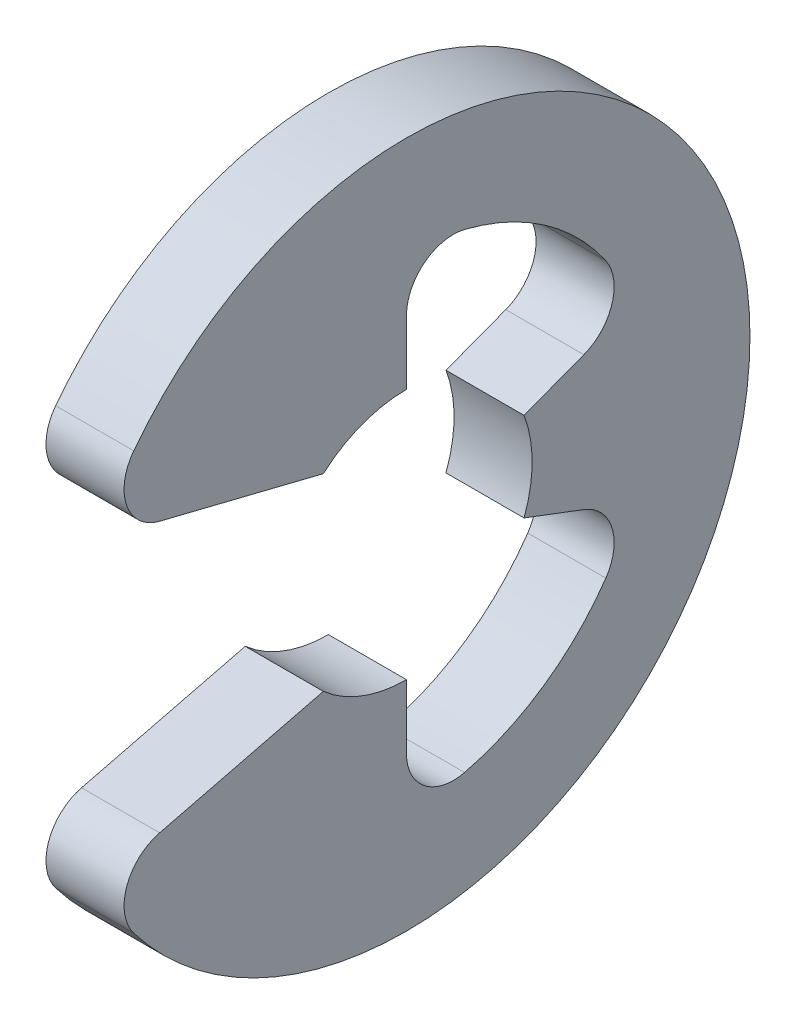
ISO-10303-21;
HEADER;
FILE_DESCRIPTION(('STEP AP214'),'2;1');
FILE_NAME('part.step','',(''),(''),'','','');
FILE_SCHEMA(('AUTOMOTIVE_DESIGN { 1 0 10303 214 1 1 1 1 }'));
ENDSEC;
DATA;
#1=APPLICATION_CONTEXT('core data for automotive mechanical design processes');
#2=APPLICATION_PROTOCOL_DEFINITION('international standard','automotive_design',2000,#1);
#3=PRODUCT_CONTEXT('',#1,'mechanical');
#4=PRODUCT('Part','Part','',(#3));
#5=PRODUCT_RELATED_PRODUCT_CATEGORY('part','',(#4));
#6=PRODUCT_DEFINITION_FORMATION('','',#4);
#7=PRODUCT_DEFINITION_CONTEXT('part definition',#1,'design');
#8=PRODUCT_DEFINITION('design','',#6,#7);
#9=PRODUCT_DEFINITION_SHAPE('','',#8);
#10=(LENGTH_UNIT() NAMED_UNIT(*) SI_UNIT(.MILLI.,.METRE.));
#11=(NAMED_UNIT(*) PLANE_ANGLE_UNIT() SI_UNIT($,.RADIAN.));
#12=(NAMED_UNIT(*) SI_UNIT($,.STERADIAN.) SOLID_ANGLE_UNIT());
#13=UNCERTAINTY_MEASURE_WITH_UNIT(LENGTH_MEASURE(1.E-05),#10,'distance_accuracy_value','');
#14=(GEOMETRIC_REPRESENTATION_CONTEXT(3) GLOBAL_UNCERTAINTY_ASSIGNED_CONTEXT((#13)) GLOBAL_UNIT_ASSIGNED_CONTEXT((#10,
#11,#12)) REPRESENTATION_CONTEXT('',''));
#15=CARTESIAN_POINT('',(0.,0.,0.));
#16=DIRECTION('',(0.,0.,1.));
#17=DIRECTION('',(1.,0.,0.));
#18=AXIS2_PLACEMENT_3D('',#15,#16,#17);
#19=CARTESIAN_POINT('',(0.25,0.,0.));
#20=DIRECTION('',(-1.,0.,0.));
#21=DIRECTION('',(0.,0.,1.));
#22=AXIS2_PLACEMENT_3D('',#19,#20,#21);
#23=CYLINDRICAL_SURFACE('',#22,2.2);
#24=CARTESIAN_POINT('',(0.25,0.,0.));
#25=DIRECTION('',(1.,0.,0.));
#26=DIRECTION('',(0.,0.,-1.));
#27=AXIS2_PLACEMENT_3D('',#24,#25,#26);
#28=CIRCLE('',#27,2.2);
#29=CARTESIAN_POINT('',(0.249999999999945,-1.33757286853182,1.74668223251034));
#30=VERTEX_POINT('',#29);
#31=CARTESIAN_POINT('',(0.249999999999834,1.33757286853182,1.74668223251034));
#32=VERTEX_POINT('',#31);
#33=EDGE_CURVE('E178',#30,#32,#28,.T.);
#34=ORIENTED_EDGE('',*,*,#33,.F.);
#35=DIRECTION('',(-1.,0.,0.));
#36=VECTOR('',#35,1.);
#37=CARTESIAN_POINT('',(0.249999999999945,-1.33757286853182,1.74668223251034));
#38=LINE('',#37,#36);
#39=CARTESIAN_POINT('',(-0.250000000000056,-1.33757286853185,1.7466822325104));
#40=VERTEX_POINT('',#39);
#41=EDGE_CURVE('E308',#30,#40,#38,.T.);
#42=ORIENTED_EDGE('',*,*,#41,.T.);
#43=CARTESIAN_POINT('',(-0.25,0.,0.));
#44=DIRECTION('',(1.,0.,0.));
#45=DIRECTION('',(0.,0.,-1.));
#46=AXIS2_PLACEMENT_3D('',#43,#44,#45);
#47=CIRCLE('',#46,2.2);
#48=CARTESIAN_POINT('',(-0.250000000000167,1.33757286853185,1.7466822325104));
#49=VERTEX_POINT('',#48);
#50=EDGE_CURVE('E228',#40,#49,#47,.T.);
#51=ORIENTED_EDGE('',*,*,#50,.T.);
#52=DIRECTION('',(-1.,0.,0.));
#53=VECTOR('',#52,1.);
#54=CARTESIAN_POINT('',(0.249999999999834,1.33757286853182,1.74668223251034));
#55=LINE('',#54,#53);
#56=EDGE_CURVE('E305',#49,#32,#55,.F.);
#57=ORIENTED_EDGE('',*,*,#56,.T.);
#58=EDGE_LOOP('',(#34,#42,#51,#57));
#59=FACE_BOUND('',#58,.T.);
#60=ADVANCED_FACE('F38',(#59),#23,.T.);
#61=CARTESIAN_POINT('',(0.249999999999778,0.962679314189765,1.9781932509314));
#62=DIRECTION('',(0.,0.970536829925373,-0.240952820606873));
#63=DIRECTION('',(0.,0.240952820606873,0.970536829925373));
#64=AXIS2_PLACEMENT_3D('',#61,#62,#63);
#65=PLANE('',#64);
#66=DIRECTION('',(0.,-0.240952820606873,-0.970536829925373));
#67=VECTOR('',#66,1.);
#68=CARTESIAN_POINT('',(0.249999999999778,0.962679314189765,1.9781932509314));
#69=LINE('',#68,#67);
#70=CARTESIAN_POINT('',(0.250000000000056,0.864015519299904,1.58078413789547));
#71=VERTEX_POINT('',#70);
#72=CARTESIAN_POINT('',(0.249999999999924,0.603749999999986,0.532457451351692));
#73=VERTEX_POINT('',#72);
#74=EDGE_CURVE('E163',#71,#73,#69,.T.);
#75=ORIENTED_EDGE('',*,*,#74,.F.);
#76=DIRECTION('',(-1.,0.,0.));
#77=VECTOR('',#76,1.);
#78=CARTESIAN_POINT('',(0.250000000000056,0.864015519299904,1.58078413789547));
#79=LINE('',#78,#77);
#80=CARTESIAN_POINT('',(-0.249999999999945,0.864015519299877,1.58078413789559));
#81=VERTEX_POINT('',#80);
#82=EDGE_CURVE('E326',#71,#81,#79,.T.);
#83=ORIENTED_EDGE('',*,*,#82,.T.);
#84=DIRECTION('',(0.,-0.240952820606873,-0.970536829925373));
#85=VECTOR('',#84,1.);
#86=CARTESIAN_POINT('',(-0.250000000000222,0.962679314189821,1.97819325093151));
#87=LINE('',#86,#85);
#88=CARTESIAN_POINT('',(-0.250000000000077,0.603750000000014,0.532457451351748));
#89=VERTEX_POINT('',#88);
#90=EDGE_CURVE('E184',#81,#89,#87,.T.);
#91=ORIENTED_EDGE('',*,*,#90,.T.);
#92=DIRECTION('',(-1.,0.,0.));
#93=VECTOR('',#92,1.);
#94=CARTESIAN_POINT('',(0.249999999999924,0.603749999999986,0.532457451351692));
#95=LINE('',#94,#93);
#96=EDGE_CURVE('E181',#73,#89,#95,.T.);
#97=ORIENTED_EDGE('',*,*,#96,.F.);
#98=EDGE_LOOP('',(#75,#83,#91,#97));
#99=FACE_BOUND('',#98,.T.);
#100=ADVANCED_FACE('F182',(#99),#65,.F.);
#101=CARTESIAN_POINT('',(0.25,0.,0.));
#102=DIRECTION('',(-1.,0.,0.));
#103=DIRECTION('',(0.,0.,1.));
#104=AXIS2_PLACEMENT_3D('',#101,#102,#103);
#105=CYLINDRICAL_SURFACE('',#104,0.805);
#106=CARTESIAN_POINT('',(-0.25,0.,0.));
#107=DIRECTION('',(-1.,0.,0.));
#108=DIRECTION('',(0.,0.,1.));
#109=AXIS2_PLACEMENT_3D('',#106,#107,#108);
#110=CIRCLE('',#109,0.805);
#111=CARTESIAN_POINT('',(-0.25,0.805,0.));
#112=VERTEX_POINT('',#111);
#113=EDGE_CURVE('E234',#89,#112,#110,.T.);
#114=ORIENTED_EDGE('',*,*,#113,.T.);
#115=DIRECTION('',(-1.,0.,0.));
#116=VECTOR('',#115,1.);
#117=CARTESIAN_POINT('',(0.25,0.805000000000042,-1.11022302462516E-13));
#118=LINE('',#117,#116);
#119=CARTESIAN_POINT('',(0.25,0.805000000000042,-1.11022302462516E-13));
#120=VERTEX_POINT('',#119);
#121=EDGE_CURVE('E189',#120,#112,#118,.T.);
#122=ORIENTED_EDGE('',*,*,#121,.F.);
#123=CARTESIAN_POINT('',(0.25,0.,0.));
#124=DIRECTION('',(-1.,0.,0.));
#125=DIRECTION('',(0.,0.,1.));
#126=AXIS2_PLACEMENT_3D('',#123,#124,#125);
#127=CIRCLE('',#126,0.805);
#128=EDGE_CURVE('E169',#73,#120,#127,.T.);
#129=ORIENTED_EDGE('',*,*,#128,.F.);
#130=ORIENTED_EDGE('',*,*,#96,.T.);
#131=EDGE_LOOP('',(#114,#122,#129,#130));
#132=FACE_BOUND('',#131,.T.);
#133=ADVANCED_FACE('F191',(#132),#105,.F.);
#134=CARTESIAN_POINT('',(0.25,0.805000000000042,-1.11022302462516E-13));
#135=DIRECTION('',(0.,0.,1.));
#136=DIRECTION('',(0.,-1.,0.));
#137=AXIS2_PLACEMENT_3D('',#134,#135,#136);
#138=PLANE('',#137);
#139=DIRECTION('',(0.,1.,0.));
#140=VECTOR('',#139,1.);
#141=CARTESIAN_POINT('',(-0.25,0.805,0.));
#142=LINE('',#141,#140);
#143=CARTESIAN_POINT('',(-0.249999999999889,1.21446296417932,0.));
#144=VERTEX_POINT('',#143);
#145=EDGE_CURVE('E237',#112,#144,#142,.T.);
#146=ORIENTED_EDGE('',*,*,#145,.T.);
#147=DIRECTION('',(1.,0.,0.));
#148=VECTOR('',#147,1.);
#149=CARTESIAN_POINT('',(0.250000000000111,1.21446296417935,-1.11022302462516E-13));
#150=LINE('',#149,#148);
#151=CARTESIAN_POINT('',(0.250000000000111,1.21446296417935,-1.11022302462516E-13));
#152=VERTEX_POINT('',#151);
#153=EDGE_CURVE('E302',#144,#152,#150,.T.);
#154=ORIENTED_EDGE('',*,*,#153,.T.);
#155=DIRECTION('',(0.,1.,0.));
#156=VECTOR('',#155,1.);
#157=CARTESIAN_POINT('',(0.25,0.805000000000042,-1.11022302462516E-13));
#158=LINE('',#157,#156);
#159=EDGE_CURVE('E195',#120,#152,#158,.T.);
#160=ORIENTED_EDGE('',*,*,#159,.F.);
#161=ORIENTED_EDGE('',*,*,#121,.T.);
#162=EDGE_LOOP('',(#146,#154,#160,#161));
#163=FACE_BOUND('',#162,.T.);
#164=ADVANCED_FACE('F458',(#163),#138,.F.);
#165=CARTESIAN_POINT('',(0.25,0.,0.));
#166=DIRECTION('',(-1.,0.,0.));
#167=DIRECTION('',(0.,0.,1.));
#168=AXIS2_PLACEMENT_3D('',#165,#166,#167);
#169=CYLINDRICAL_SURFACE('',#168,1.55096774193548);
#170=CARTESIAN_POINT('',(0.25,0.,0.));
#171=DIRECTION('',(-1.,0.,0.));
#172=DIRECTION('',(0.,0.,-1.));
#173=AXIS2_PLACEMENT_3D('',#170,#171,#172);
#174=CIRCLE('',#173,1.55096774193548);
#175=CARTESIAN_POINT('',(0.250000000000167,1.50570859509386,-0.371944301186228));
#176=VERTEX_POINT('',#175);
#177=CARTESIAN_POINT('',(0.249999999999855,0.880270414541348,-1.27695925299445));
#178=VERTEX_POINT('',#177);
#179=EDGE_CURVE('E199',#176,#178,#174,.T.);
#180=ORIENTED_EDGE('',*,*,#179,.F.);
#181=DIRECTION('',(-1.,0.,0.));
#182=VECTOR('',#181,1.);
#183=CARTESIAN_POINT('',(0.250000000000167,1.50570859509386,-0.371944301186228));
#184=LINE('',#183,#182);
#185=CARTESIAN_POINT('',(-0.249999999999834,1.50570859509387,-0.371944301186145));
#186=VERTEX_POINT('',#185);
#187=EDGE_CURVE('E298',#176,#186,#184,.T.);
#188=ORIENTED_EDGE('',*,*,#187,.T.);
#189=CARTESIAN_POINT('',(-0.25,0.,0.));
#190=DIRECTION('',(-1.,0.,0.));
#191=DIRECTION('',(0.,0.,-1.));
#192=AXIS2_PLACEMENT_3D('',#189,#190,#191);
#193=CIRCLE('',#192,1.55096774193548);
#194=CARTESIAN_POINT('',(-0.250000000000146,0.880270414541362,-1.27695925299418));
#195=VERTEX_POINT('',#194);
#196=EDGE_CURVE('E241',#186,#195,#193,.T.);
#197=ORIENTED_EDGE('',*,*,#196,.T.);
#198=DIRECTION('',(-1.,0.,0.));
#199=VECTOR('',#198,1.);
#200=CARTESIAN_POINT('',(0.249999999999855,0.880270414541348,-1.27695925299445));
#201=LINE('',#200,#199);
#202=EDGE_CURVE('E295',#195,#178,#201,.F.);
#203=ORIENTED_EDGE('',*,*,#202,.T.);
#204=EDGE_LOOP('',(#180,#188,#197,#203));
#205=FACE_BOUND('',#204,.T.);
#206=ADVANCED_FACE('F365',(#205),#169,.F.);
#207=CARTESIAN_POINT('',(0.250000000000056,0.284610479427627,-0.753008549088385));
#208=DIRECTION('',(0.,-0.935414346693485,-0.353553390593274));
#209=DIRECTION('',(0.,0.353553390593274,-0.935414346693485));
#210=AXIS2_PLACEMENT_3D('',#207,#208,#209);
#211=PLANE('',#210);
#212=DIRECTION('',(0.,-0.353553390593274,0.935414346693485));
#213=VECTOR('',#212,1.);
#214=CARTESIAN_POINT('',(0.250000000000056,0.284610479427627,-0.753008549088385));
#215=LINE('',#214,#213);
#216=CARTESIAN_POINT('',(0.249999999999743,0.429377498735603,-1.13602608022154));
#217=VERTEX_POINT('',#216);
#218=CARTESIAN_POINT('',(0.250000000000056,0.284610479427627,-0.753008549088385));
#219=VERTEX_POINT('',#218);
#220=EDGE_CURVE('E205',#217,#219,#215,.T.);
#221=ORIENTED_EDGE('',*,*,#220,.F.);
#222=DIRECTION('',(1.,0.,0.));
#223=VECTOR('',#222,1.);
#224=CARTESIAN_POINT('',(-0.250000000000257,0.429377498735561,-1.13602608022109));
#225=LINE('',#224,#223);
#226=CARTESIAN_POINT('',(-0.250000000000257,0.429377498735561,-1.13602608022109));
#227=VERTEX_POINT('',#226);
#228=EDGE_CURVE('E331',#217,#227,#225,.F.);
#229=ORIENTED_EDGE('',*,*,#228,.T.);
#230=DIRECTION('',(0.,-0.353553390593274,0.935414346693485));
#231=VECTOR('',#230,1.);
#232=CARTESIAN_POINT('',(-0.249999999999945,0.284610479427599,-0.753008549088247));
#233=LINE('',#232,#231);
#234=CARTESIAN_POINT('',(-0.249999999999945,0.284610479427599,-0.753008549088247));
#235=VERTEX_POINT('',#234);
#236=EDGE_CURVE('E245',#227,#235,#233,.T.);
#237=ORIENTED_EDGE('',*,*,#236,.T.);
#238=DIRECTION('',(-1.,0.,0.));
#239=VECTOR('',#238,1.);
#240=CARTESIAN_POINT('',(0.250000000000056,0.284610479427627,-0.753008549088385));
#241=LINE('',#240,#239);
#242=EDGE_CURVE('E279',#219,#235,#241,.T.);
#243=ORIENTED_EDGE('',*,*,#242,.F.);
#244=EDGE_LOOP('',(#221,#229,#237,#243));
#245=FACE_BOUND('',#244,.T.);
#246=ADVANCED_FACE('F368',(#245),#211,.F.);
#247=CARTESIAN_POINT('',(0.25,0.,0.));
#248=DIRECTION('',(-1.,0.,0.));
#249=DIRECTION('',(0.,0.,1.));
#250=AXIS2_PLACEMENT_3D('',#247,#248,#249);
#251=CYLINDRICAL_SURFACE('',#250,0.805);
#252=CARTESIAN_POINT('',(-0.25,0.,0.));
#253=DIRECTION('',(-1.,0.,0.));
#254=DIRECTION('',(0.,0.,1.));
#255=AXIS2_PLACEMENT_3D('',#252,#253,#254);
#256=CIRCLE('',#255,0.805);
#257=CARTESIAN_POINT('',(-0.249999999999945,-0.284610479427599,-0.753008549088247));
#258=VERTEX_POINT('',#257);
#259=EDGE_CURVE('E248',#235,#258,#256,.T.);
#260=ORIENTED_EDGE('',*,*,#259,.T.);
#261=DIRECTION('',(-1.,0.,0.));
#262=VECTOR('',#261,1.);
#263=CARTESIAN_POINT('',(0.250000000000056,-0.284610479427599,-0.753008549088247));
#264=LINE('',#263,#262);
#265=CARTESIAN_POINT('',(0.250000000000056,-0.284610479427599,-0.753008549088247));
#266=VERTEX_POINT('',#265);
#267=EDGE_CURVE('E275',#266,#258,#264,.T.);
#268=ORIENTED_EDGE('',*,*,#267,.F.);
#269=CARTESIAN_POINT('',(0.25,0.,0.));
#270=DIRECTION('',(-1.,0.,0.));
#271=DIRECTION('',(0.,0.,1.));
#272=AXIS2_PLACEMENT_3D('',#269,#270,#271);
#273=CIRCLE('',#272,0.805);
#274=EDGE_CURVE('E208',#219,#266,#273,.T.);
#275=ORIENTED_EDGE('',*,*,#274,.F.);
#276=ORIENTED_EDGE('',*,*,#242,.T.);
#277=EDGE_LOOP('',(#260,#268,#275,#276));
#278=FACE_BOUND('',#277,.T.);
#279=ADVANCED_FACE('F374',(#278),#251,.F.);
#280=CARTESIAN_POINT('',(0.250000000000056,-0.284610479427599,-0.753008549088247));
#281=DIRECTION('',(0.,0.935414346693485,-0.353553390593274));
#282=DIRECTION('',(0.,0.353553390593274,0.935414346693485));
#283=AXIS2_PLACEMENT_3D('',#280,#281,#282);
#284=PLANE('',#283);
#285=DIRECTION('',(0.,-0.353553390593274,-0.935414346693485));
#286=VECTOR('',#285,1.);
#287=CARTESIAN_POINT('',(-0.249999999999945,-0.284610479427599,-0.753008549088247));
#288=LINE('',#287,#286);
#289=CARTESIAN_POINT('',(-0.250000000000257,-0.429377498735506,-1.13602608022104));
#290=VERTEX_POINT('',#289);
#291=EDGE_CURVE('E251',#258,#290,#288,.T.);
#292=ORIENTED_EDGE('',*,*,#291,.T.);
#293=DIRECTION('',(1.,0.,0.));
#294=VECTOR('',#293,1.);
#295=CARTESIAN_POINT('',(0.249999999999743,-0.429377498735506,-1.13602608022137));
#296=LINE('',#295,#294);
#297=CARTESIAN_POINT('',(0.249999999999743,-0.429377498735506,-1.13602608022137));
#298=VERTEX_POINT('',#297);
#299=EDGE_CURVE('E54',#290,#298,#296,.T.);
#300=ORIENTED_EDGE('',*,*,#299,.T.);
#301=DIRECTION('',(0.,-0.353553390593274,-0.935414346693485));
#302=VECTOR('',#301,1.);
#303=CARTESIAN_POINT('',(0.250000000000056,-0.284610479427599,-0.753008549088247));
#304=LINE('',#303,#302);
#305=EDGE_CURVE('E211',#266,#298,#304,.T.);
#306=ORIENTED_EDGE('',*,*,#305,.F.);
#307=ORIENTED_EDGE('',*,*,#267,.T.);
#308=EDGE_LOOP('',(#292,#300,#306,#307));
#309=FACE_BOUND('',#308,.T.);
#310=ADVANCED_FACE('F376',(#309),#284,.F.);
#311=CARTESIAN_POINT('',(0.25,0.,0.));
#312=DIRECTION('',(-1.,0.,0.));
#313=DIRECTION('',(0.,0.,1.));
#314=AXIS2_PLACEMENT_3D('',#311,#312,#313);
#315=CYLINDRICAL_SURFACE('',#314,1.55096774193548);
#316=CARTESIAN_POINT('',(-0.25,0.,0.));
#317=DIRECTION('',(-1.,0.,0.));
#318=DIRECTION('',(0.,0.,-1.));
#319=AXIS2_PLACEMENT_3D('',#316,#317,#318);
#320=CIRCLE('',#319,1.55096774193548);
#321=CARTESIAN_POINT('',(-0.250000000000215,-0.880270414541307,-1.27695925299415));
#322=VERTEX_POINT('',#321);
#323=CARTESIAN_POINT('',(-0.249999999999945,-1.50570859509387,-0.371944301186172));
#324=VERTEX_POINT('',#323);
#325=EDGE_CURVE('E254',#322,#324,#320,.T.);
#326=ORIENTED_EDGE('',*,*,#325,.T.);
#327=DIRECTION('',(-1.,0.,0.));
#328=VECTOR('',#327,1.);
#329=CARTESIAN_POINT('',(0.250000000000056,-1.50570859509391,-0.371944301186283));
#330=LINE('',#329,#328);
#331=CARTESIAN_POINT('',(0.250000000000056,-1.50570859509391,-0.371944301186283));
#332=VERTEX_POINT('',#331);
#333=EDGE_CURVE('E292',#324,#332,#330,.F.);
#334=ORIENTED_EDGE('',*,*,#333,.T.);
#335=CARTESIAN_POINT('',(0.25,0.,0.));
#336=DIRECTION('',(-1.,0.,0.));
#337=DIRECTION('',(0.,0.,-1.));
#338=AXIS2_PLACEMENT_3D('',#335,#336,#337);
#339=CIRCLE('',#338,1.55096774193548);
#340=CARTESIAN_POINT('',(0.249999999999785,-0.880270414541265,-1.27695925299451));
#341=VERTEX_POINT('',#340);
#342=EDGE_CURVE('E214',#341,#332,#339,.T.);
#343=ORIENTED_EDGE('',*,*,#342,.F.);
#344=DIRECTION('',(-1.,0.,0.));
#345=VECTOR('',#344,1.);
#346=CARTESIAN_POINT('',(0.249999999999785,-0.880270414541265,-1.27695925299451));
#347=LINE('',#346,#345);
#348=EDGE_CURVE('E288',#341,#322,#347,.T.);
#349=ORIENTED_EDGE('',*,*,#348,.T.);
#350=EDGE_LOOP('',(#326,#334,#343,#349));
#351=FACE_BOUND('',#350,.T.);
#352=ADVANCED_FACE('F378',(#351),#315,.F.);
#353=CARTESIAN_POINT('',(0.25,-0.805000000000014,-1.38777878078145E-13));
#354=DIRECTION('',(0.,0.,1.));
#355=DIRECTION('',(0.,-1.,0.));
#356=AXIS2_PLACEMENT_3D('',#353,#354,#355);
#357=PLANE('',#356);
#358=DIRECTION('',(0.,1.,0.));
#359=VECTOR('',#358,1.);
#360=CARTESIAN_POINT('',(0.25,-0.805000000000014,-1.38777878078145E-13));
#361=LINE('',#360,#359);
#362=CARTESIAN_POINT('',(0.25,-1.21446296417931,0.));
#363=VERTEX_POINT('',#362);
#364=CARTESIAN_POINT('',(0.25,-0.805000000000014,-1.38777878078145E-13));
#365=VERTEX_POINT('',#364);
#366=EDGE_CURVE('E218',#363,#365,#361,.T.);
#367=ORIENTED_EDGE('',*,*,#366,.F.);
#368=DIRECTION('',(1.,0.,0.));
#369=VECTOR('',#368,1.);
#370=CARTESIAN_POINT('',(-0.25,-1.21446296417931,0.));
#371=LINE('',#370,#369);
#372=CARTESIAN_POINT('',(-0.25,-1.21446296417931,0.));
#373=VERTEX_POINT('',#372);
#374=EDGE_CURVE('E188',#363,#373,#371,.F.);
#375=ORIENTED_EDGE('',*,*,#374,.T.);
#376=DIRECTION('',(0.,1.,0.));
#377=VECTOR('',#376,1.);
#378=CARTESIAN_POINT('',(-0.25,-0.804999999999986,0.));
#379=LINE('',#378,#377);
#380=CARTESIAN_POINT('',(-0.25,-0.804999999999986,0.));
#381=VERTEX_POINT('',#380);
#382=EDGE_CURVE('E258',#373,#381,#379,.T.);
#383=ORIENTED_EDGE('',*,*,#382,.T.);
#384=DIRECTION('',(-1.,0.,0.));
#385=VECTOR('',#384,1.);
#386=CARTESIAN_POINT('',(0.25,-0.805000000000014,-1.38777878078145E-13));
#387=LINE('',#386,#385);
#388=EDGE_CURVE('E271',#365,#381,#387,.T.);
#389=ORIENTED_EDGE('',*,*,#388,.F.);
#390=EDGE_LOOP('',(#367,#375,#383,#389));
#391=FACE_BOUND('',#390,.T.);
#392=ADVANCED_FACE('F384',(#391),#357,.F.);
#393=CARTESIAN_POINT('',(0.25,0.,0.));
#394=DIRECTION('',(-1.,0.,0.));
#395=DIRECTION('',(0.,0.,1.));
#396=AXIS2_PLACEMENT_3D('',#393,#394,#395);
#397=CYLINDRICAL_SURFACE('',#396,0.805);
#398=CARTESIAN_POINT('',(-0.25,0.,0.));
#399=DIRECTION('',(-1.,0.,0.));
#400=DIRECTION('',(0.,0.,-1.));
#401=AXIS2_PLACEMENT_3D('',#398,#399,#400);
#402=CIRCLE('',#401,0.805);
#403=CARTESIAN_POINT('',(-0.250000000000007,-0.603749999999986,0.532457451351748));
#404=VERTEX_POINT('',#403);
#405=EDGE_CURVE('E261',#381,#404,#402,.T.);
#406=ORIENTED_EDGE('',*,*,#405,.T.);
#407=DIRECTION('',(-1.,0.,0.));
#408=VECTOR('',#407,1.);
#409=CARTESIAN_POINT('',(0.249999999999993,-0.603749999999903,0.532457451351553));
#410=LINE('',#409,#408);
#411=CARTESIAN_POINT('',(0.249999999999993,-0.603749999999903,0.532457451351553));
#412=VERTEX_POINT('',#411);
#413=EDGE_CURVE('E227',#412,#404,#410,.T.);
#414=ORIENTED_EDGE('',*,*,#413,.F.);
#415=CARTESIAN_POINT('',(0.25,0.,0.));
#416=DIRECTION('',(-1.,0.,0.));
#417=DIRECTION('',(0.,0.,-1.));
#418=AXIS2_PLACEMENT_3D('',#415,#416,#417);
#419=CIRCLE('',#418,0.805);
#420=EDGE_CURVE('E221',#365,#412,#419,.T.);
#421=ORIENTED_EDGE('',*,*,#420,.F.);
#422=ORIENTED_EDGE('',*,*,#388,.T.);
#423=EDGE_LOOP('',(#406,#414,#421,#422));
#424=FACE_BOUND('',#423,.T.);
#425=ADVANCED_FACE('F433',(#424),#397,.F.);
#426=CARTESIAN_POINT('',(0.249999999999778,-0.962679314189821,1.97819325093146));
#427=DIRECTION('',(0.,-0.970536829925373,-0.240952820606873));
#428=DIRECTION('',(0.,0.240952820606873,-0.970536829925373));
#429=AXIS2_PLACEMENT_3D('',#426,#427,#428);
#430=PLANE('',#429);
#431=DIRECTION('',(0.,-0.240952820606873,0.970536829925373));
#432=VECTOR('',#431,1.);
#433=CARTESIAN_POINT('',(-0.250000000000222,-0.962679314189793,1.97819325093154));
#434=LINE('',#433,#432);
#435=CARTESIAN_POINT('',(-0.249999999999945,-0.864015519299863,1.58078413789559));
#436=VERTEX_POINT('',#435);
#437=EDGE_CURVE('E264',#404,#436,#434,.T.);
#438=ORIENTED_EDGE('',*,*,#437,.T.);
#439=DIRECTION('',(-1.,0.,0.));
#440=VECTOR('',#439,1.);
#441=CARTESIAN_POINT('',(0.250000000000056,-0.864015519299904,1.58078413789547));
#442=LINE('',#441,#440);
#443=CARTESIAN_POINT('',(0.250000000000056,-0.864015519299904,1.58078413789547));
#444=VERTEX_POINT('',#443);
#445=EDGE_CURVE('E318',#436,#444,#442,.F.);
#446=ORIENTED_EDGE('',*,*,#445,.T.);
#447=DIRECTION('',(0.,-0.240952820606873,0.970536829925373));
#448=VECTOR('',#447,1.);
#449=CARTESIAN_POINT('',(0.249999999999778,-0.962679314189821,1.97819325093146));
#450=LINE('',#449,#448);
#451=EDGE_CURVE('E224',#412,#444,#450,.T.);
#452=ORIENTED_EDGE('',*,*,#451,.F.);
#453=ORIENTED_EDGE('',*,*,#413,.T.);
#454=EDGE_LOOP('',(#438,#446,#452,#453));
#455=FACE_BOUND('',#454,.T.);
#456=ADVANCED_FACE('F505',(#455),#430,.F.);
#457=CARTESIAN_POINT('',(0.25,0.,0.));
#458=DIRECTION('',(1.,0.,0.));
#459=DIRECTION('',(0.,0.,-1.));
#460=AXIS2_PLACEMENT_3D('',#457,#458,#459);
#461=PLANE('',#460);
#462=ORIENTED_EDGE('',*,*,#451,.T.);
#463=CARTESIAN_POINT('',(0.250000000000056,-1.15517656827749,1.50849829171337));
#464=DIRECTION('',(1.,0.,0.));
#465=DIRECTION('',(0.,0.,-1.));
#466=AXIS2_PLACEMENT_3D('',#463,#464,#465);
#467=CIRCLE('',#466,0.3);
#468=EDGE_CURVE('E323',#444,#30,#467,.T.);
#469=ORIENTED_EDGE('',*,*,#468,.T.);
#470=ORIENTED_EDGE('',*,*,#33,.T.);
#471=CARTESIAN_POINT('',(0.250000000000056,1.15517656827752,1.50849829171348));
#472=DIRECTION('',(1.,0.,0.));
#473=DIRECTION('',(0.,0.,-1.));
#474=AXIS2_PLACEMENT_3D('',#471,#472,#473);
#475=CIRCLE('',#474,0.3);
#476=EDGE_CURVE('E173',#32,#71,#475,.T.);
#477=ORIENTED_EDGE('',*,*,#476,.T.);
#478=ORIENTED_EDGE('',*,*,#74,.T.);
#479=ORIENTED_EDGE('',*,*,#128,.T.);
#480=ORIENTED_EDGE('',*,*,#159,.T.);
#481=CARTESIAN_POINT('',(0.250000000000167,1.21446296417933,-0.300000000000106));
#482=DIRECTION('',(1.,0.,0.));
#483=DIRECTION('',(0.,0.,-1.));
#484=AXIS2_PLACEMENT_3D('',#481,#482,#483);
#485=CIRCLE('',#484,0.3);
#486=EDGE_CURVE('E344',#152,#176,#485,.F.);
#487=ORIENTED_EDGE('',*,*,#486,.T.);
#488=ORIENTED_EDGE('',*,*,#179,.T.);
#489=CARTESIAN_POINT('',(0.249999999999855,0.710001802743609,-1.0299600630434));
#490=DIRECTION('',(1.,0.,0.));
#491=DIRECTION('',(0.,0.,-1.));
#492=AXIS2_PLACEMENT_3D('',#489,#490,#491);
#493=CIRCLE('',#492,0.3);
#494=EDGE_CURVE('E11',#178,#217,#493,.F.);
#495=ORIENTED_EDGE('',*,*,#494,.T.);
#496=ORIENTED_EDGE('',*,*,#220,.T.);
#497=ORIENTED_EDGE('',*,*,#274,.T.);
#498=ORIENTED_EDGE('',*,*,#305,.T.);
#499=CARTESIAN_POINT('',(0.249999999999785,-0.710001802743609,-1.02996006304337));
#500=DIRECTION('',(1.,0.,0.));
#501=DIRECTION('',(0.,0.,-1.));
#502=AXIS2_PLACEMENT_3D('',#499,#500,#501);
#503=CIRCLE('',#502,0.3);
#504=EDGE_CURVE('E350',#298,#341,#503,.F.);
#505=ORIENTED_EDGE('',*,*,#504,.T.);
#506=ORIENTED_EDGE('',*,*,#342,.T.);
#507=CARTESIAN_POINT('',(0.250000000000056,-1.21446296417931,-0.300000000000078));
#508=DIRECTION('',(1.,0.,0.));
#509=DIRECTION('',(0.,0.,-1.));
#510=AXIS2_PLACEMENT_3D('',#507,#508,#509);
#511=CIRCLE('',#510,0.3);
#512=EDGE_CURVE('E338',#332,#363,#511,.F.);
#513=ORIENTED_EDGE('',*,*,#512,.T.);
#514=ORIENTED_EDGE('',*,*,#366,.T.);
#515=ORIENTED_EDGE('',*,*,#420,.T.);
#516=EDGE_LOOP('',(#462,#469,#470,#477,#478,#479,#480,#487,#488,#495,#496,#497,#498,#505,#506,
#513,#514,#515));
#517=FACE_BOUND('',#516,.T.);
#518=ADVANCED_FACE('F166',(#517),#461,.T.);
#519=CARTESIAN_POINT('',(-0.25,0.,0.));
#520=DIRECTION('',(1.,0.,0.));
#521=DIRECTION('',(0.,0.,-1.));
#522=AXIS2_PLACEMENT_3D('',#519,#520,#521);
#523=PLANE('',#522);
#524=ORIENTED_EDGE('',*,*,#50,.F.);
#525=CARTESIAN_POINT('',(-0.249999999999945,-1.1551765682775,1.50849829171351));
#526=DIRECTION('',(1.,0.,0.));
#527=DIRECTION('',(0.,0.,-1.));
#528=AXIS2_PLACEMENT_3D('',#525,#526,#527);
#529=CIRCLE('',#528,0.3);
#530=EDGE_CURVE('E315',#40,#436,#529,.F.);
#531=ORIENTED_EDGE('',*,*,#530,.T.);
#532=ORIENTED_EDGE('',*,*,#437,.F.);
#533=ORIENTED_EDGE('',*,*,#405,.F.);
#534=ORIENTED_EDGE('',*,*,#382,.F.);
#535=CARTESIAN_POINT('',(-0.249999999999945,-1.21446296417929,-0.299999999999995));
#536=DIRECTION('',(1.,0.,0.));
#537=DIRECTION('',(0.,0.,-1.));
#538=AXIS2_PLACEMENT_3D('',#535,#536,#537);
#539=CIRCLE('',#538,0.3);
#540=EDGE_CURVE('E335',#373,#324,#539,.T.);
#541=ORIENTED_EDGE('',*,*,#540,.T.);
#542=ORIENTED_EDGE('',*,*,#325,.F.);
#543=CARTESIAN_POINT('',(-0.250000000000215,-0.710001802743554,-1.02996006304309));
#544=DIRECTION('',(1.,0.,0.));
#545=DIRECTION('',(0.,0.,-1.));
#546=AXIS2_PLACEMENT_3D('',#543,#544,#545);
#547=CIRCLE('',#546,0.3);
#548=EDGE_CURVE('E347',#322,#290,#547,.T.);
#549=ORIENTED_EDGE('',*,*,#548,.T.);
#550=ORIENTED_EDGE('',*,*,#291,.F.);
#551=ORIENTED_EDGE('',*,*,#259,.F.);
#552=ORIENTED_EDGE('',*,*,#236,.F.);
#553=CARTESIAN_POINT('',(-0.250000000000146,0.710001802743609,-1.02996006304312));
#554=DIRECTION('',(1.,0.,0.));
#555=DIRECTION('',(0.,0.,-1.));
#556=AXIS2_PLACEMENT_3D('',#553,#554,#555);
#557=CIRCLE('',#556,0.3);
#558=EDGE_CURVE('E47',#227,#195,#557,.T.);
#559=ORIENTED_EDGE('',*,*,#558,.T.);
#560=ORIENTED_EDGE('',*,*,#196,.F.);
#561=CARTESIAN_POINT('',(-0.249999999999834,1.21446296417931,-0.299999999999995));
#562=DIRECTION('',(1.,0.,0.));
#563=DIRECTION('',(0.,0.,-1.));
#564=AXIS2_PLACEMENT_3D('',#561,#562,#563);
#565=CIRCLE('',#564,0.3);
#566=EDGE_CURVE('E341',#186,#144,#565,.T.);
#567=ORIENTED_EDGE('',*,*,#566,.T.);
#568=ORIENTED_EDGE('',*,*,#145,.F.);
#569=ORIENTED_EDGE('',*,*,#113,.F.);
#570=ORIENTED_EDGE('',*,*,#90,.F.);
#571=CARTESIAN_POINT('',(-0.249999999999945,1.15517656827749,1.50849829171351));
#572=DIRECTION('',(1.,0.,0.));
#573=DIRECTION('',(0.,0.,-1.));
#574=AXIS2_PLACEMENT_3D('',#571,#572,#573);
#575=CIRCLE('',#574,0.3);
#576=EDGE_CURVE('E312',#81,#49,#575,.F.);
#577=ORIENTED_EDGE('',*,*,#576,.T.);
#578=EDGE_LOOP('',(#524,#531,#532,#533,#534,#541,#542,#549,#550,#551,#552,#559,#560,#567,#568,
#569,#570,#577));
#579=FACE_BOUND('',#578,.T.);
#580=ADVANCED_FACE('F358',(#579),#523,.F.);
#581=CARTESIAN_POINT('',(0.250000000000056,-1.21446296417931,-0.300000000000078));
#582=DIRECTION('',(-1.,0.,0.));
#583=DIRECTION('',(0.,0.,1.));
#584=AXIS2_PLACEMENT_3D('',#581,#582,#583);
#585=CYLINDRICAL_SURFACE('',#584,0.3);
#586=ORIENTED_EDGE('',*,*,#512,.F.);
#587=ORIENTED_EDGE('',*,*,#333,.F.);
#588=ORIENTED_EDGE('',*,*,#540,.F.);
#589=ORIENTED_EDGE('',*,*,#374,.F.);
#590=EDGE_LOOP('',(#586,#587,#588,#589));
#591=FACE_BOUND('',#590,.T.);
#592=ADVANCED_FACE('F398',(#591),#585,.F.);
#593=CARTESIAN_POINT('',(0.250000000000167,1.21446296417933,-0.300000000000106));
#594=DIRECTION('',(-1.,0.,0.));
#595=DIRECTION('',(0.,0.,1.));
#596=AXIS2_PLACEMENT_3D('',#593,#594,#595);
#597=CYLINDRICAL_SURFACE('',#596,0.3);
#598=ORIENTED_EDGE('',*,*,#486,.F.);
#599=ORIENTED_EDGE('',*,*,#153,.F.);
#600=ORIENTED_EDGE('',*,*,#566,.F.);
#601=ORIENTED_EDGE('',*,*,#187,.F.);
#602=EDGE_LOOP('',(#598,#599,#600,#601));
#603=FACE_BOUND('',#602,.T.);
#604=ADVANCED_FACE('F401',(#603),#597,.F.);
#605=CARTESIAN_POINT('',(0.250000000000056,-1.15517656827749,1.50849829171337));
#606=DIRECTION('',(-1.,0.,0.));
#607=DIRECTION('',(0.,0.,1.));
#608=AXIS2_PLACEMENT_3D('',#605,#606,#607);
#609=CYLINDRICAL_SURFACE('',#608,0.3);
#610=ORIENTED_EDGE('',*,*,#468,.F.);
#611=ORIENTED_EDGE('',*,*,#445,.F.);
#612=ORIENTED_EDGE('',*,*,#530,.F.);
#613=ORIENTED_EDGE('',*,*,#41,.F.);
#614=EDGE_LOOP('',(#610,#611,#612,#613));
#615=FACE_BOUND('',#614,.T.);
#616=ADVANCED_FACE('F405',(#615),#609,.T.);
#617=CARTESIAN_POINT('',(0.250000000000056,1.15517656827752,1.50849829171348));
#618=DIRECTION('',(-1.,0.,0.));
#619=DIRECTION('',(0.,0.,1.));
#620=AXIS2_PLACEMENT_3D('',#617,#618,#619);
#621=CYLINDRICAL_SURFACE('',#620,0.3);
#622=ORIENTED_EDGE('',*,*,#476,.F.);
#623=ORIENTED_EDGE('',*,*,#56,.F.);
#624=ORIENTED_EDGE('',*,*,#576,.F.);
#625=ORIENTED_EDGE('',*,*,#82,.F.);
#626=EDGE_LOOP('',(#622,#623,#624,#625));
#627=FACE_BOUND('',#626,.T.);
#628=ADVANCED_FACE('F409',(#627),#621,.T.);
#629=CARTESIAN_POINT('',(0.249999999999785,-0.710001802743609,-1.02996006304337));
#630=DIRECTION('',(-1.,0.,0.));
#631=DIRECTION('',(0.,0.,1.));
#632=AXIS2_PLACEMENT_3D('',#629,#630,#631);
#633=CYLINDRICAL_SURFACE('',#632,0.3);
#634=ORIENTED_EDGE('',*,*,#504,.F.);
#635=ORIENTED_EDGE('',*,*,#299,.F.);
#636=ORIENTED_EDGE('',*,*,#548,.F.);
#637=ORIENTED_EDGE('',*,*,#348,.F.);
#638=EDGE_LOOP('',(#634,#635,#636,#637));
#639=FACE_BOUND('',#638,.T.);
#640=ADVANCED_FACE('F412',(#639),#633,.F.);
#641=CARTESIAN_POINT('',(0.249999999999855,0.710001802743609,-1.0299600630434));
#642=DIRECTION('',(-1.,0.,0.));
#643=DIRECTION('',(0.,0.,1.));
#644=AXIS2_PLACEMENT_3D('',#641,#642,#643);
#645=CYLINDRICAL_SURFACE('',#644,0.3);
#646=ORIENTED_EDGE('',*,*,#494,.F.);
#647=ORIENTED_EDGE('',*,*,#202,.F.);
#648=ORIENTED_EDGE('',*,*,#558,.F.);
#649=ORIENTED_EDGE('',*,*,#228,.F.);
#650=EDGE_LOOP('',(#646,#647,#648,#649));
#651=FACE_BOUND('',#650,.T.);
#652=ADVANCED_FACE('F40',(#651),#645,.F.);
#653=CLOSED_SHELL('',(#60,#100,#133,#164,#206,#246,#279,#310,#352,#392,#425,#456,#518,#580,#592,
#604,#616,#628,#640,#652));
#654=MANIFOLD_SOLID_BREP('B2',#653);
#655=ADVANCED_BREP_SHAPE_REPRESENTATION('',(#18,#654),#14);
#656=SHAPE_DEFINITION_REPRESENTATION(#9,#655);
ENDSEC;
END-ISO-10303-21;
